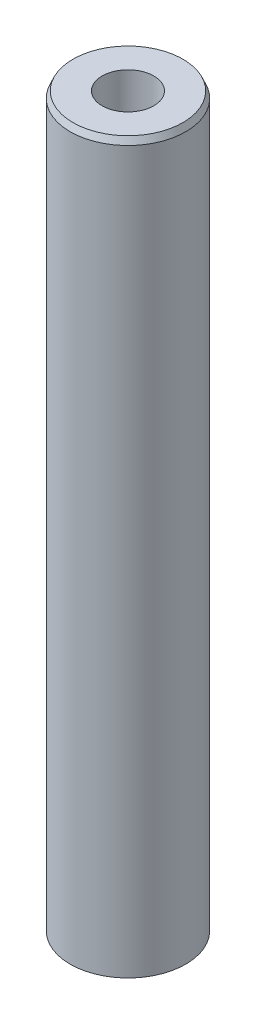
ISO-10303-21;
HEADER;
FILE_DESCRIPTION(('STEP AP214'),'2;1');
FILE_NAME('part.step','',(''),(''),'','','');
FILE_SCHEMA(('AUTOMOTIVE_DESIGN { 1 0 10303 214 1 1 1 1 }'));
ENDSEC;
DATA;
#1=APPLICATION_CONTEXT('core data for automotive mechanical design processes');
#2=APPLICATION_PROTOCOL_DEFINITION('international standard','automotive_design',2000,#1);
#3=PRODUCT_CONTEXT('',#1,'mechanical');
#4=PRODUCT('Part','Part','',(#3));
#5=PRODUCT_RELATED_PRODUCT_CATEGORY('part','',(#4));
#6=PRODUCT_DEFINITION_FORMATION('','',#4);
#7=PRODUCT_DEFINITION_CONTEXT('part definition',#1,'design');
#8=PRODUCT_DEFINITION('design','',#6,#7);
#9=PRODUCT_DEFINITION_SHAPE('','',#8);
#10=(LENGTH_UNIT() NAMED_UNIT(*) SI_UNIT(.MILLI.,.METRE.));
#11=(NAMED_UNIT(*) PLANE_ANGLE_UNIT() SI_UNIT($,.RADIAN.));
#12=(NAMED_UNIT(*) SI_UNIT($,.STERADIAN.) SOLID_ANGLE_UNIT());
#13=UNCERTAINTY_MEASURE_WITH_UNIT(LENGTH_MEASURE(1.E-05),#10,'distance_accuracy_value','');
#14=(GEOMETRIC_REPRESENTATION_CONTEXT(3) GLOBAL_UNCERTAINTY_ASSIGNED_CONTEXT((#13)) GLOBAL_UNIT_ASSIGNED_CONTEXT((#10,
#11,#12)) REPRESENTATION_CONTEXT('',''));
#15=CARTESIAN_POINT('',(0.,0.,0.));
#16=DIRECTION('',(0.,0.,1.));
#17=DIRECTION('',(1.,0.,0.));
#18=AXIS2_PLACEMENT_3D('',#15,#16,#17);
#19=CARTESIAN_POINT('',(0.,600.,0.));
#20=DIRECTION('',(0.,-1.,0.));
#21=DIRECTION('',(0.,0.,-1.));
#22=AXIS2_PLACEMENT_3D('',#19,#20,#21);
#23=CYLINDRICAL_SURFACE('',#22,47.5);
#24=CARTESIAN_POINT('',(0.,594.6765112826,0.));
#25=DIRECTION('',(0.,1.,0.));
#26=DIRECTION('',(0.,0.,1.));
#27=AXIS2_PLACEMENT_3D('',#24,#25,#26);
#28=CIRCLE('',#27,47.5);
#29=CARTESIAN_POINT('',(0.,594.6765112826,47.5));
#30=VERTEX_POINT('',#29);
#31=EDGE_CURVE('E50',#30,#30,#28,.F.);
#32=ORIENTED_EDGE('',*,*,#31,.T.);
#33=EDGE_LOOP('',(#32));
#34=FACE_BOUND('',#33,.T.);
#35=CARTESIAN_POINT('',(0.,2.34141631908968,0.));
#36=DIRECTION('',(0.,1.,0.));
#37=DIRECTION('',(0.,0.,1.));
#38=AXIS2_PLACEMENT_3D('',#35,#36,#37);
#39=CIRCLE('',#38,47.5);
#40=CARTESIAN_POINT('',(0.,2.34141631908968,47.5));
#41=VERTEX_POINT('',#40);
#42=EDGE_CURVE('E51',#41,#41,#39,.T.);
#43=ORIENTED_EDGE('',*,*,#42,.T.);
#44=EDGE_LOOP('',(#43));
#45=FACE_BOUND('',#44,.T.);
#46=ADVANCED_FACE('F39',(#34,#45),#23,.T.);
#47=CARTESIAN_POINT('',(0.,600.,0.));
#48=DIRECTION('',(0.,1.,0.));
#49=DIRECTION('',(0.,0.,1.));
#50=AXIS2_PLACEMENT_3D('',#47,#48,#49);
#51=PLANE('',#50);
#52=CARTESIAN_POINT('',(0.,600.,0.));
#53=DIRECTION('',(0.,1.,0.));
#54=DIRECTION('',(0.,0.,1.));
#55=AXIS2_PLACEMENT_3D('',#52,#53,#54);
#56=CIRCLE('',#55,45.1585836809103);
#57=CARTESIAN_POINT('',(0.,600.,45.1585836809103));
#58=VERTEX_POINT('',#57);
#59=EDGE_CURVE('E54',#58,#58,#56,.T.);
#60=ORIENTED_EDGE('',*,*,#59,.T.);
#61=EDGE_LOOP('',(#60));
#62=FACE_BOUND('',#61,.T.);
#63=CARTESIAN_POINT('',(0.,600.,0.));
#64=DIRECTION('',(0.,1.,0.));
#65=DIRECTION('',(0.,0.,1.));
#66=AXIS2_PLACEMENT_3D('',#63,#64,#65);
#67=CIRCLE('',#66,21.2407231901143);
#68=CARTESIAN_POINT('',(0.,600.,21.2407231901143));
#69=VERTEX_POINT('',#68);
#70=EDGE_CURVE('E58',#69,#69,#67,.T.);
#71=ORIENTED_EDGE('',*,*,#70,.F.);
#72=EDGE_LOOP('',(#71));
#73=FACE_BOUND('',#72,.T.);
#74=ADVANCED_FACE('F69',(#62,#73),#51,.T.);
#75=CARTESIAN_POINT('',(0.,0.,0.));
#76=DIRECTION('',(0.,1.,0.));
#77=DIRECTION('',(0.,0.,1.));
#78=AXIS2_PLACEMENT_3D('',#75,#76,#77);
#79=PLANE('',#78);
#80=CARTESIAN_POINT('',(0.,0.,0.));
#81=DIRECTION('',(0.,1.,0.));
#82=DIRECTION('',(0.,0.,1.));
#83=AXIS2_PLACEMENT_3D('',#80,#81,#82);
#84=CIRCLE('',#83,42.1765112825999);
#85=CARTESIAN_POINT('',(0.,0.,42.1765112825999));
#86=VERTEX_POINT('',#85);
#87=EDGE_CURVE('E10',#86,#86,#84,.F.);
#88=ORIENTED_EDGE('',*,*,#87,.T.);
#89=EDGE_LOOP('',(#88));
#90=FACE_BOUND('',#89,.T.);
#91=CARTESIAN_POINT('',(0.,0.,0.));
#92=DIRECTION('',(0.,1.,0.));
#93=DIRECTION('',(0.,0.,1.));
#94=AXIS2_PLACEMENT_3D('',#91,#92,#93);
#95=CIRCLE('',#94,21.2407231901143);
#96=CARTESIAN_POINT('',(0.,0.,21.2407231901143));
#97=VERTEX_POINT('',#96);
#98=EDGE_CURVE('E63',#97,#97,#95,.T.);
#99=ORIENTED_EDGE('',*,*,#98,.T.);
#100=EDGE_LOOP('',(#99));
#101=FACE_BOUND('',#100,.T.);
#102=ADVANCED_FACE('F75',(#90,#101),#79,.F.);
#103=CARTESIAN_POINT('',(0.,600.,0.));
#104=DIRECTION('',(0.,-1.,0.));
#105=DIRECTION('',(0.,0.,-1.));
#106=AXIS2_PLACEMENT_3D('',#103,#104,#105);
#107=CYLINDRICAL_SURFACE('',#106,21.2407231901143);
#108=ORIENTED_EDGE('',*,*,#70,.T.);
#109=EDGE_LOOP('',(#108));
#110=FACE_BOUND('',#109,.T.);
#111=ORIENTED_EDGE('',*,*,#98,.F.);
#112=EDGE_LOOP('',(#111));
#113=FACE_BOUND('',#112,.T.);
#114=ADVANCED_FACE('F70',(#110,#113),#107,.F.);
#115=CARTESIAN_POINT('',(0.,600.,0.));
#116=DIRECTION('',(0.,-1.,0.));
#117=DIRECTION('',(0.,0.,-1.));
#118=AXIS2_PLACEMENT_3D('',#115,#116,#117);
#119=CONICAL_SURFACE('',#118,45.1585836809103,0.414362279334839);
#120=ORIENTED_EDGE('',*,*,#31,.F.);
#121=EDGE_LOOP('',(#120));
#122=FACE_BOUND('',#121,.T.);
#123=ORIENTED_EDGE('',*,*,#59,.F.);
#124=EDGE_LOOP('',(#123));
#125=FACE_BOUND('',#124,.T.);
#126=ADVANCED_FACE('F81',(#122,#125),#119,.T.);
#127=CARTESIAN_POINT('',(0.,2.34141631908968,0.));
#128=DIRECTION('',(0.,1.,0.));
#129=DIRECTION('',(0.,0.,1.));
#130=AXIS2_PLACEMENT_3D('',#127,#128,#129);
#131=CONICAL_SURFACE('',#130,47.5,1.15643404746006);
#132=CARTESIAN_POINT('',(0.,0.,42.1765112825999));
#133=CARTESIAN_POINT('',(0.,0.0243897533238505,42.2319642900728));
#134=CARTESIAN_POINT('',(0.,0.0487795066477013,42.2874172975458));
#135=CARTESIAN_POINT('',(0.,0.0975590132954031,42.3983233124916));
#136=CARTESIAN_POINT('',(0.,0.121948766619254,42.4537763199645));
#137=CARTESIAN_POINT('',(0.,0.170728273266956,42.5646823349103));
#138=CARTESIAN_POINT('',(0.,0.195118026590807,42.6201353423833));
#139=CARTESIAN_POINT('',(0.,0.243897533238508,42.7310413573291));
#140=CARTESIAN_POINT('',(0.,0.268287286562359,42.786494364802));
#141=CARTESIAN_POINT('',(0.,0.317066793210061,42.8974003797478));
#142=CARTESIAN_POINT('',(0.,0.341456546533912,42.9528533872208));
#143=CARTESIAN_POINT('',(0.,0.390236053181614,43.0637594021666));
#144=CARTESIAN_POINT('',(0.,0.414625806505464,43.1192124096395));
#145=CARTESIAN_POINT('',(0.,0.463405313153166,43.2301184245853));
#146=CARTESIAN_POINT('',(0.,0.487795066477017,43.2855714320583));
#147=CARTESIAN_POINT('',(0.,0.536574573124719,43.3964774470041));
#148=CARTESIAN_POINT('',(0.,0.560964326448569,43.451930454477));
#149=CARTESIAN_POINT('',(0.,0.609743833096271,43.5628364694228));
#150=CARTESIAN_POINT('',(0.,0.634133586420123,43.6182894768958));
#151=CARTESIAN_POINT('',(0.,0.682913093067824,43.7291954918416));
#152=CARTESIAN_POINT('',(0.,0.707302846391674,43.7846484993145));
#153=CARTESIAN_POINT('',(0.,0.756082353039376,43.8955545142604));
#154=CARTESIAN_POINT('',(0.,0.780472106363227,43.9510075217333));
#155=CARTESIAN_POINT('',(0.,0.829251613010929,44.0619135366791));
#156=CARTESIAN_POINT('',(0.,0.85364136633478,44.117366544152));
#157=CARTESIAN_POINT('',(0.,0.902420872982482,44.2282725590979));
#158=CARTESIAN_POINT('',(0.,0.926810626306333,44.2837255665708));
#159=CARTESIAN_POINT('',(0.,0.975590132954035,44.3946315815166));
#160=CARTESIAN_POINT('',(0.,0.999979886277885,44.4500845889895));
#161=CARTESIAN_POINT('',(0.,1.04875939292559,44.5609906039354));
#162=CARTESIAN_POINT('',(0.,1.07314914624944,44.6164436114083));
#163=CARTESIAN_POINT('',(0.,1.12192865289714,44.7273496263541));
#164=CARTESIAN_POINT('',(0.,1.14631840622099,44.782802633827));
#165=CARTESIAN_POINT('',(0.,1.19509791286869,44.8937086487729));
#166=CARTESIAN_POINT('',(0.,1.21948766619254,44.9491616562458));
#167=CARTESIAN_POINT('',(0.,1.26826717284025,45.0600676711916));
#168=CARTESIAN_POINT('',(0.,1.2926569261641,45.1155206786645));
#169=CARTESIAN_POINT('',(0.,1.3414364328118,45.2264266936104));
#170=CARTESIAN_POINT('',(0.,1.36582618613565,45.2818797010833));
#171=CARTESIAN_POINT('',(0.,1.41460569278335,45.3927857160291));
#172=CARTESIAN_POINT('',(0.,1.4389954461072,45.4482387235021));
#173=CARTESIAN_POINT('',(0.,1.4877749527549,45.5591447384479));
#174=CARTESIAN_POINT('',(0.,1.51216470607875,45.6145977459208));
#175=CARTESIAN_POINT('',(0.,1.56094421272646,45.7255037608666));
#176=CARTESIAN_POINT('',(0.,1.58533396605031,45.7809567683396));
#177=CARTESIAN_POINT('',(0.,1.63411347269801,45.8918627832854));
#178=CARTESIAN_POINT('',(0.,1.65850322602186,45.9473157907583));
#179=CARTESIAN_POINT('',(0.,1.70728273266956,46.0582218057041));
#180=CARTESIAN_POINT('',(0.,1.73167248599341,46.1136748131771));
#181=CARTESIAN_POINT('',(0.,1.78045199264111,46.2245808281229));
#182=CARTESIAN_POINT('',(0.,1.80484174596496,46.2800338355958));
#183=CARTESIAN_POINT('',(0.,1.85362125261267,46.3909398505416));
#184=CARTESIAN_POINT('',(0.,1.87801100593652,46.4463928580146));
#185=CARTESIAN_POINT('',(0.,1.92679051258422,46.5572988729604));
#186=CARTESIAN_POINT('',(0.,1.95118026590807,46.6127518804333));
#187=CARTESIAN_POINT('',(0.,1.99995977255577,46.7236578953792));
#188=CARTESIAN_POINT('',(0.,2.02434952587962,46.7791109028521));
#189=CARTESIAN_POINT('',(0.,2.07312903252732,46.8900169177979));
#190=CARTESIAN_POINT('',(0.,2.09751878585117,46.9454699252708));
#191=CARTESIAN_POINT('',(0.,2.14629829249888,47.0563759402167));
#192=CARTESIAN_POINT('',(0.,2.17068804582273,47.1118289476896));
#193=CARTESIAN_POINT('',(0.,2.21946755247043,47.2227349626354));
#194=CARTESIAN_POINT('',(0.,2.24385730579428,47.2781879701083));
#195=CARTESIAN_POINT('',(0.,2.29263681244198,47.3890939850542));
#196=CARTESIAN_POINT('',(0.,2.31702656576583,47.4445469925271));
#197=CARTESIAN_POINT('',(0.,2.34141631908968,47.5));
#198=B_SPLINE_CURVE_WITH_KNOTS('',3,(#132,#133,#134,#135,#136,#137,#138,#139,#140,#141,#142,
#143,#144,#145,#146,#147,#148,#149,#150,#151,#152,#153,#154,#155,#156,#157,#158,#159,#160,#161,
#162,#163,#164,#165,#166,#167,#168,#169,#170,#171,#172,#173,#174,#175,#176,#177,#178,#179,#180,
#181,#182,#183,#184,#185,#186,#187,#188,#189,#190,#191,#192,#193,#194,#195,#196,#197),
.UNSPECIFIED.,.F.,.F.,(4,2,2,2,2,2,2,2,2,2,2,2,2,2,2,2,2,2,2,2,2,2,2,2,2,2,2,2,2,2,2,2,4),(0.,
0.181739002266733,0.363478004533466,0.545217006800199,0.726956009066932,0.908695011333665,
1.0904340136004,1.27217301586713,1.45391201813386,1.6356510204006,1.81739002266734,
1.99912902493407,2.1808680272008,2.36260702946753,2.54434603173427,2.726085034001,
2.90782403626773,3.08956303853447,3.2713020408012,3.45304104306794,3.63478004533467,
3.81651904760141,3.99825804986814,4.17999705213487,4.3617360544016,4.54347505666834,
4.72521405893507,4.9069530612018,5.08869206346854,5.27043106573527,5.45217006800201,
5.63390907026874,5.81564807253547),.UNSPECIFIED.);
#199=EDGE_CURVE('BSEAM45',#86,#41,#198,.T.);
#200=ORIENTED_EDGE('',*,*,#87,.F.);
#201=ORIENTED_EDGE('',*,*,#42,.F.);
#202=ORIENTED_EDGE('',*,*,#199,.T.);
#203=ORIENTED_EDGE('',*,*,#199,.F.);
#204=EDGE_LOOP('',(#200,#202,#201,#203));
#205=FACE_BOUND('',#204,.T.);
#206=ADVANCED_FACE('F45',(#205),#131,.T.);
#207=CLOSED_SHELL('',(#46,#74,#102,#114,#126,#206));
#208=MANIFOLD_SOLID_BREP('B2',#207);
#209=ADVANCED_BREP_SHAPE_REPRESENTATION('',(#18,#208),#14);
#210=SHAPE_DEFINITION_REPRESENTATION(#9,#209);
ENDSEC;
END-ISO-10303-21;
